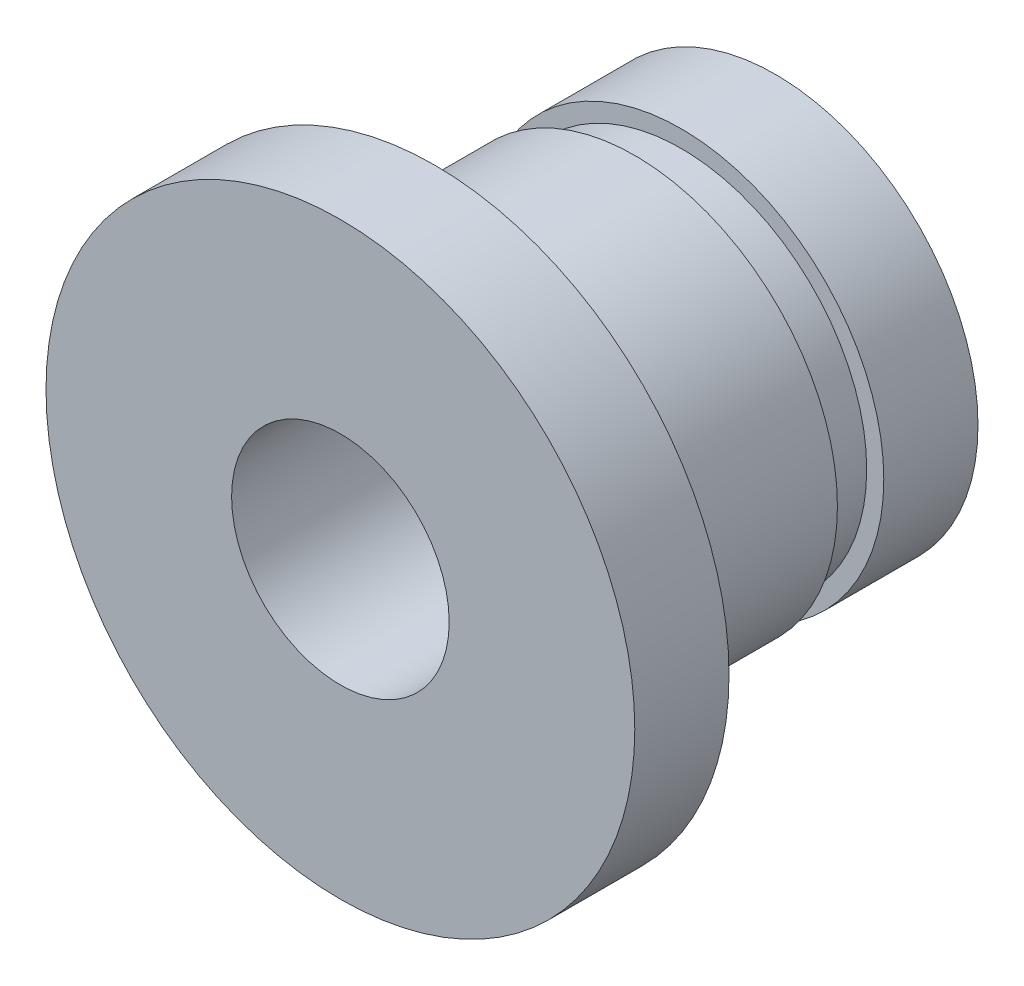
ISO-10303-21;
HEADER;
FILE_DESCRIPTION(('STEP AP214'),'2;1');
FILE_NAME('part.step','',(''),(''),'','','');
FILE_SCHEMA(('AUTOMOTIVE_DESIGN { 1 0 10303 214 1 1 1 1 }'));
ENDSEC;
DATA;
#1=APPLICATION_CONTEXT('core data for automotive mechanical design processes');
#2=APPLICATION_PROTOCOL_DEFINITION('international standard','automotive_design',2000,#1);
#3=PRODUCT_CONTEXT('',#1,'mechanical');
#4=PRODUCT('Part','Part','',(#3));
#5=PRODUCT_RELATED_PRODUCT_CATEGORY('part','',(#4));
#6=PRODUCT_DEFINITION_FORMATION('','',#4);
#7=PRODUCT_DEFINITION_CONTEXT('part definition',#1,'design');
#8=PRODUCT_DEFINITION('design','',#6,#7);
#9=PRODUCT_DEFINITION_SHAPE('','',#8);
#10=(LENGTH_UNIT() NAMED_UNIT(*) SI_UNIT(.MILLI.,.METRE.));
#11=(NAMED_UNIT(*) PLANE_ANGLE_UNIT() SI_UNIT($,.RADIAN.));
#12=(NAMED_UNIT(*) SI_UNIT($,.STERADIAN.) SOLID_ANGLE_UNIT());
#13=UNCERTAINTY_MEASURE_WITH_UNIT(LENGTH_MEASURE(1.E-05),#10,'distance_accuracy_value','');
#14=(GEOMETRIC_REPRESENTATION_CONTEXT(3) GLOBAL_UNCERTAINTY_ASSIGNED_CONTEXT((#13)) GLOBAL_UNIT_ASSIGNED_CONTEXT((#10,
#11,#12)) REPRESENTATION_CONTEXT('',''));
#15=CARTESIAN_POINT('',(0.,0.,0.));
#16=DIRECTION('',(0.,0.,1.));
#17=DIRECTION('',(1.,0.,0.));
#18=AXIS2_PLACEMENT_3D('',#15,#16,#17);
#19=CARTESIAN_POINT('',(0.,5.461,0.));
#20=DIRECTION('',(0.,0.,1.));
#21=DIRECTION('',(-1.,0.,0.));
#22=AXIS2_PLACEMENT_3D('',#19,#20,#21);
#23=PLANE('',#22);
#24=CARTESIAN_POINT('',(0.,0.,0.));
#25=DIRECTION('',(0.,0.,1.));
#26=DIRECTION('',(1.,0.,0.));
#27=AXIS2_PLACEMENT_3D('',#24,#25,#26);
#28=CIRCLE('',#27,2.9337);
#29=CARTESIAN_POINT('',(2.9337,0.,0.));
#30=VERTEX_POINT('',#29);
#31=EDGE_CURVE('E71',#30,#30,#28,.T.);
#32=ORIENTED_EDGE('',*,*,#31,.T.);
#33=EDGE_LOOP('',(#32));
#34=FACE_BOUND('',#33,.T.);
#35=CARTESIAN_POINT('',(0.,0.,0.));
#36=DIRECTION('',(0.,0.,1.));
#37=DIRECTION('',(1.,0.,0.));
#38=AXIS2_PLACEMENT_3D('',#35,#36,#37);
#39=CIRCLE('',#38,5.461);
#40=CARTESIAN_POINT('',(5.461,0.,0.));
#41=VERTEX_POINT('',#40);
#42=EDGE_CURVE('E10',#41,#41,#39,.T.);
#43=ORIENTED_EDGE('',*,*,#42,.F.);
#44=EDGE_LOOP('',(#43));
#45=FACE_BOUND('',#44,.T.);
#46=ADVANCED_FACE('F34',(#34,#45),#23,.F.);
#47=CARTESIAN_POINT('',(0.,0.,0.));
#48=DIRECTION('',(0.,0.,-1.));
#49=DIRECTION('',(1.,0.,0.));
#50=AXIS2_PLACEMENT_3D('',#47,#48,#49);
#51=CYLINDRICAL_SURFACE('',#50,5.461);
#52=ORIENTED_EDGE('',*,*,#42,.T.);
#53=EDGE_LOOP('',(#52));
#54=FACE_BOUND('',#53,.T.);
#55=CARTESIAN_POINT('',(0.,0.,2.54));
#56=DIRECTION('',(0.,0.,1.));
#57=DIRECTION('',(1.,0.,0.));
#58=AXIS2_PLACEMENT_3D('',#55,#56,#57);
#59=CIRCLE('',#58,5.461);
#60=CARTESIAN_POINT('',(5.461,0.,2.54));
#61=VERTEX_POINT('',#60);
#62=EDGE_CURVE('E40',#61,#61,#59,.T.);
#63=ORIENTED_EDGE('',*,*,#62,.F.);
#64=EDGE_LOOP('',(#63));
#65=FACE_BOUND('',#64,.T.);
#66=ADVANCED_FACE('F89',(#54,#65),#51,.T.);
#67=CARTESIAN_POINT('',(0.,5.,2.54));
#68=DIRECTION('',(0.,0.,-1.));
#69=DIRECTION('',(1.,0.,0.));
#70=AXIS2_PLACEMENT_3D('',#67,#68,#69);
#71=PLANE('',#70);
#72=ORIENTED_EDGE('',*,*,#62,.T.);
#73=EDGE_LOOP('',(#72));
#74=FACE_BOUND('',#73,.T.);
#75=CARTESIAN_POINT('',(0.,0.,2.54));
#76=DIRECTION('',(0.,0.,1.));
#77=DIRECTION('',(1.,0.,0.));
#78=AXIS2_PLACEMENT_3D('',#75,#76,#77);
#79=CIRCLE('',#78,5.);
#80=CARTESIAN_POINT('',(5.,0.,2.54));
#81=VERTEX_POINT('',#80);
#82=EDGE_CURVE('E44',#81,#81,#79,.T.);
#83=ORIENTED_EDGE('',*,*,#82,.F.);
#84=EDGE_LOOP('',(#83));
#85=FACE_BOUND('',#84,.T.);
#86=ADVANCED_FACE('F93',(#74,#85),#71,.F.);
#87=CARTESIAN_POINT('',(0.,0.,0.));
#88=DIRECTION('',(0.,0.,-1.));
#89=DIRECTION('',(1.,0.,0.));
#90=AXIS2_PLACEMENT_3D('',#87,#88,#89);
#91=CYLINDRICAL_SURFACE('',#90,5.);
#92=ORIENTED_EDGE('',*,*,#82,.T.);
#93=EDGE_LOOP('',(#92));
#94=FACE_BOUND('',#93,.T.);
#95=CARTESIAN_POINT('',(0.,0.,3.79));
#96=DIRECTION('',(0.,0.,1.));
#97=DIRECTION('',(1.,0.,0.));
#98=AXIS2_PLACEMENT_3D('',#95,#96,#97);
#99=CIRCLE('',#98,5.);
#100=CARTESIAN_POINT('',(5.,0.,3.79));
#101=VERTEX_POINT('',#100);
#102=EDGE_CURVE('E48',#101,#101,#99,.T.);
#103=ORIENTED_EDGE('',*,*,#102,.F.);
#104=EDGE_LOOP('',(#103));
#105=FACE_BOUND('',#104,.T.);
#106=ADVANCED_FACE('F97',(#94,#105),#91,.T.);
#107=CARTESIAN_POINT('',(0.,5.461,3.79));
#108=DIRECTION('',(0.,0.,1.));
#109=DIRECTION('',(-1.,0.,0.));
#110=AXIS2_PLACEMENT_3D('',#107,#108,#109);
#111=PLANE('',#110);
#112=ORIENTED_EDGE('',*,*,#102,.T.);
#113=EDGE_LOOP('',(#112));
#114=FACE_BOUND('',#113,.T.);
#115=CARTESIAN_POINT('',(0.,0.,3.79));
#116=DIRECTION('',(0.,0.,1.));
#117=DIRECTION('',(1.,0.,0.));
#118=AXIS2_PLACEMENT_3D('',#115,#116,#117);
#119=CIRCLE('',#118,5.461);
#120=CARTESIAN_POINT('',(5.461,0.,3.79));
#121=VERTEX_POINT('',#120);
#122=EDGE_CURVE('E53',#121,#121,#119,.T.);
#123=ORIENTED_EDGE('',*,*,#122,.F.);
#124=EDGE_LOOP('',(#123));
#125=FACE_BOUND('',#124,.T.);
#126=ADVANCED_FACE('F103',(#114,#125),#111,.F.);
#127=CARTESIAN_POINT('',(0.,0.,0.));
#128=DIRECTION('',(0.,0.,-1.));
#129=DIRECTION('',(1.,0.,0.));
#130=AXIS2_PLACEMENT_3D('',#127,#128,#129);
#131=CYLINDRICAL_SURFACE('',#130,5.461);
#132=ORIENTED_EDGE('',*,*,#122,.T.);
#133=EDGE_LOOP('',(#132));
#134=FACE_BOUND('',#133,.T.);
#135=CARTESIAN_POINT('',(0.,0.,9.09));
#136=DIRECTION('',(0.,0.,1.));
#137=DIRECTION('',(1.,0.,0.));
#138=AXIS2_PLACEMENT_3D('',#135,#136,#137);
#139=CIRCLE('',#138,5.461);
#140=CARTESIAN_POINT('',(5.461,0.,9.09));
#141=VERTEX_POINT('',#140);
#142=EDGE_CURVE('E56',#141,#141,#139,.T.);
#143=ORIENTED_EDGE('',*,*,#142,.F.);
#144=EDGE_LOOP('',(#143));
#145=FACE_BOUND('',#144,.T.);
#146=ADVANCED_FACE('F107',(#134,#145),#131,.T.);
#147=CARTESIAN_POINT('',(0.,0.,9.09));
#148=DIRECTION('',(0.,0.,-1.));
#149=DIRECTION('',(1.,0.,0.));
#150=AXIS2_PLACEMENT_3D('',#147,#148,#149);
#151=TOROIDAL_SURFACE('',#150,5.561,0.0999999999999998);
#152=ORIENTED_EDGE('',*,*,#142,.T.);
#153=EDGE_LOOP('',(#152));
#154=FACE_BOUND('',#153,.T.);
#155=CARTESIAN_POINT('',(0.,0.,9.19));
#156=DIRECTION('',(0.,0.,1.));
#157=DIRECTION('',(1.,0.,0.));
#158=AXIS2_PLACEMENT_3D('',#155,#156,#157);
#159=CIRCLE('',#158,5.561);
#160=CARTESIAN_POINT('',(5.561,0.,9.19));
#161=VERTEX_POINT('',#160);
#162=EDGE_CURVE('E59',#161,#161,#159,.T.);
#163=ORIENTED_EDGE('',*,*,#162,.F.);
#164=EDGE_LOOP('',(#163));
#165=FACE_BOUND('',#164,.T.);
#166=ADVANCED_FACE('F111',(#154,#165),#151,.F.);
#167=CARTESIAN_POINT('',(0.,7.9375,9.19));
#168=DIRECTION('',(0.,0.,1.));
#169=DIRECTION('',(-1.,0.,0.));
#170=AXIS2_PLACEMENT_3D('',#167,#168,#169);
#171=PLANE('',#170);
#172=ORIENTED_EDGE('',*,*,#162,.T.);
#173=EDGE_LOOP('',(#172));
#174=FACE_BOUND('',#173,.T.);
#175=CARTESIAN_POINT('',(0.,0.,9.19));
#176=DIRECTION('',(0.,0.,1.));
#177=DIRECTION('',(1.,0.,0.));
#178=AXIS2_PLACEMENT_3D('',#175,#176,#177);
#179=CIRCLE('',#178,7.9375);
#180=CARTESIAN_POINT('',(7.9375,0.,9.19));
#181=VERTEX_POINT('',#180);
#182=EDGE_CURVE('E62',#181,#181,#179,.T.);
#183=ORIENTED_EDGE('',*,*,#182,.F.);
#184=EDGE_LOOP('',(#183));
#185=FACE_BOUND('',#184,.T.);
#186=ADVANCED_FACE('F115',(#174,#185),#171,.F.);
#187=CARTESIAN_POINT('',(0.,0.,0.));
#188=DIRECTION('',(0.,0.,-1.));
#189=DIRECTION('',(1.,0.,0.));
#190=AXIS2_PLACEMENT_3D('',#187,#188,#189);
#191=CYLINDRICAL_SURFACE('',#190,7.9375);
#192=ORIENTED_EDGE('',*,*,#182,.T.);
#193=EDGE_LOOP('',(#192));
#194=FACE_BOUND('',#193,.T.);
#195=CARTESIAN_POINT('',(0.,0.,11.73));
#196=DIRECTION('',(0.,0.,1.));
#197=DIRECTION('',(1.,0.,0.));
#198=AXIS2_PLACEMENT_3D('',#195,#196,#197);
#199=CIRCLE('',#198,7.9375);
#200=CARTESIAN_POINT('',(7.9375,0.,11.73));
#201=VERTEX_POINT('',#200);
#202=EDGE_CURVE('E65',#201,#201,#199,.T.);
#203=ORIENTED_EDGE('',*,*,#202,.F.);
#204=EDGE_LOOP('',(#203));
#205=FACE_BOUND('',#204,.T.);
#206=ADVANCED_FACE('F85',(#194,#205),#191,.T.);
#207=CARTESIAN_POINT('',(0.,2.9337,11.73));
#208=DIRECTION('',(0.,0.,-1.));
#209=DIRECTION('',(1.,0.,0.));
#210=AXIS2_PLACEMENT_3D('',#207,#208,#209);
#211=PLANE('',#210);
#212=ORIENTED_EDGE('',*,*,#202,.T.);
#213=EDGE_LOOP('',(#212));
#214=FACE_BOUND('',#213,.T.);
#215=CARTESIAN_POINT('',(0.,0.,11.73));
#216=DIRECTION('',(0.,0.,1.));
#217=DIRECTION('',(1.,0.,0.));
#218=AXIS2_PLACEMENT_3D('',#215,#216,#217);
#219=CIRCLE('',#218,2.9337);
#220=CARTESIAN_POINT('',(2.9337,0.,11.73));
#221=VERTEX_POINT('',#220);
#222=EDGE_CURVE('E68',#221,#221,#219,.T.);
#223=ORIENTED_EDGE('',*,*,#222,.F.);
#224=EDGE_LOOP('',(#223));
#225=FACE_BOUND('',#224,.T.);
#226=ADVANCED_FACE('F79',(#214,#225),#211,.F.);
#227=CARTESIAN_POINT('',(0.,0.,0.));
#228=DIRECTION('',(0.,0.,-1.));
#229=DIRECTION('',(1.,0.,0.));
#230=AXIS2_PLACEMENT_3D('',#227,#228,#229);
#231=CYLINDRICAL_SURFACE('',#230,2.9337);
#232=ORIENTED_EDGE('',*,*,#222,.T.);
#233=EDGE_LOOP('',(#232));
#234=FACE_BOUND('',#233,.T.);
#235=ORIENTED_EDGE('',*,*,#31,.F.);
#236=EDGE_LOOP('',(#235));
#237=FACE_BOUND('',#236,.T.);
#238=ADVANCED_FACE('F77',(#234,#237),#231,.F.);
#239=CLOSED_SHELL('',(#46,#66,#86,#106,#126,#146,#166,#186,#206,#226,#238));
#240=MANIFOLD_SOLID_BREP('B2',#239);
#241=ADVANCED_BREP_SHAPE_REPRESENTATION('',(#18,#240),#14);
#242=SHAPE_DEFINITION_REPRESENTATION(#9,#241);
ENDSEC;
END-ISO-10303-21;
